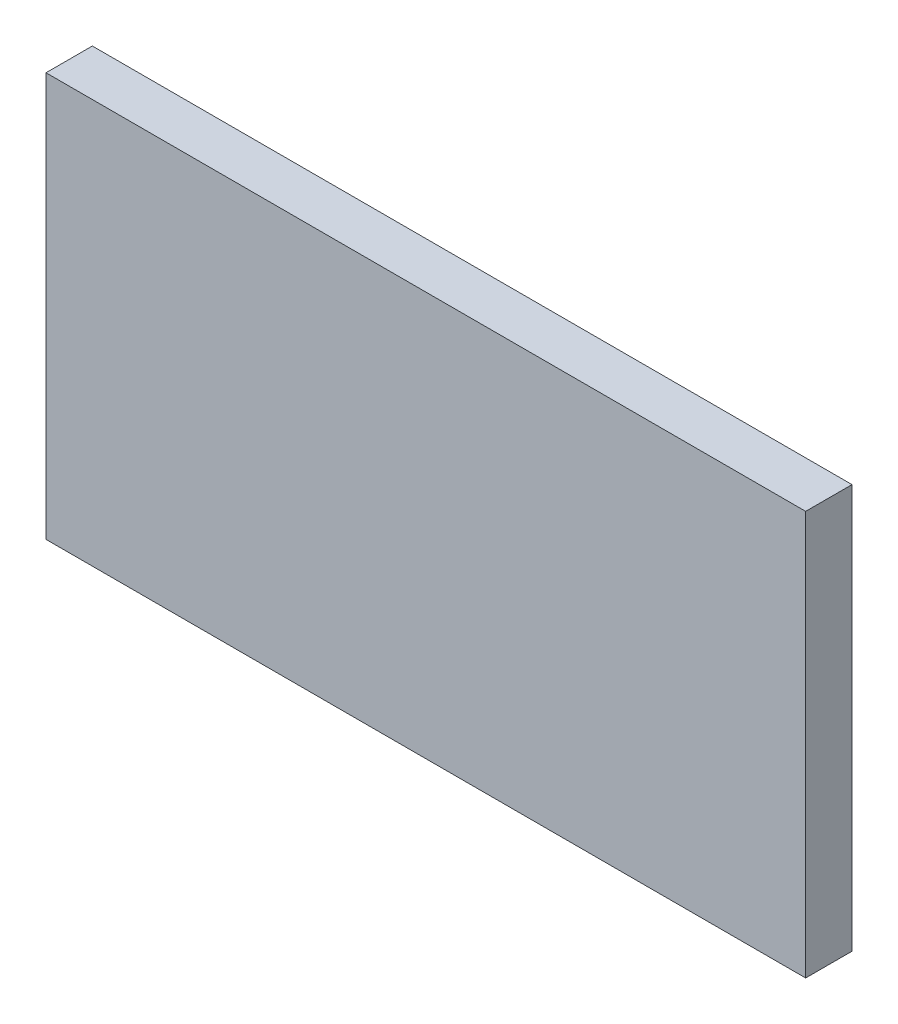
ISO-10303-21;
HEADER;
FILE_DESCRIPTION(('STEP AP214'),'2;1');
FILE_NAME('part.step','',(''),(''),'','','');
FILE_SCHEMA(('AUTOMOTIVE_DESIGN { 1 0 10303 214 1 1 1 1 }'));
ENDSEC;
DATA;
#1=APPLICATION_CONTEXT('core data for automotive mechanical design processes');
#2=APPLICATION_PROTOCOL_DEFINITION('international standard','automotive_design',2000,#1);
#3=PRODUCT_CONTEXT('',#1,'mechanical');
#4=PRODUCT('Part','Part','',(#3));
#5=PRODUCT_RELATED_PRODUCT_CATEGORY('part','',(#4));
#6=PRODUCT_DEFINITION_FORMATION('','',#4);
#7=PRODUCT_DEFINITION_CONTEXT('part definition',#1,'design');
#8=PRODUCT_DEFINITION('design','',#6,#7);
#9=PRODUCT_DEFINITION_SHAPE('','',#8);
#10=(LENGTH_UNIT() NAMED_UNIT(*) SI_UNIT(.MILLI.,.METRE.));
#11=(NAMED_UNIT(*) PLANE_ANGLE_UNIT() SI_UNIT($,.RADIAN.));
#12=(NAMED_UNIT(*) SI_UNIT($,.STERADIAN.) SOLID_ANGLE_UNIT());
#13=UNCERTAINTY_MEASURE_WITH_UNIT(LENGTH_MEASURE(1.E-05),#10,'distance_accuracy_value','');
#14=(GEOMETRIC_REPRESENTATION_CONTEXT(3) GLOBAL_UNCERTAINTY_ASSIGNED_CONTEXT((#13)) GLOBAL_UNIT_ASSIGNED_CONTEXT((#10,
#11,#12)) REPRESENTATION_CONTEXT('',''));
#15=CARTESIAN_POINT('',(0.,0.,0.));
#16=DIRECTION('',(0.,0.,1.));
#17=DIRECTION('',(1.,0.,0.));
#18=AXIS2_PLACEMENT_3D('',#15,#16,#17);
#19=CARTESIAN_POINT('',(-125.,842.370969311245,15.25));
#20=DIRECTION('',(1.,0.,0.));
#21=DIRECTION('',(0.,0.,-1.));
#22=AXIS2_PLACEMENT_3D('',#19,#20,#21);
#23=PLANE('',#22);
#24=DIRECTION('',(0.,-1.,0.));
#25=VECTOR('',#24,1.);
#26=CARTESIAN_POINT('',(-125.,842.370969311245,0.));
#27=LINE('',#26,#25);
#28=CARTESIAN_POINT('',(-125.,975.370969311245,0.));
#29=VERTEX_POINT('',#28);
#30=CARTESIAN_POINT('',(-125.,842.370969311245,0.));
#31=VERTEX_POINT('',#30);
#32=EDGE_CURVE('E96',#29,#31,#27,.T.);
#33=ORIENTED_EDGE('',*,*,#32,.T.);
#34=DIRECTION('',(0.,0.,-1.));
#35=VECTOR('',#34,1.);
#36=CARTESIAN_POINT('',(-125.,842.370969311245,15.25));
#37=LINE('',#36,#35);
#38=CARTESIAN_POINT('',(-125.,842.370969311245,15.25));
#39=VERTEX_POINT('',#38);
#40=EDGE_CURVE('E11',#39,#31,#37,.T.);
#41=ORIENTED_EDGE('',*,*,#40,.F.);
#42=DIRECTION('',(0.,-1.,0.));
#43=VECTOR('',#42,1.);
#44=CARTESIAN_POINT('',(-125.,842.370969311245,15.25));
#45=LINE('',#44,#43);
#46=CARTESIAN_POINT('',(-125.,975.370969311245,15.25));
#47=VERTEX_POINT('',#46);
#48=EDGE_CURVE('E84',#47,#39,#45,.T.);
#49=ORIENTED_EDGE('',*,*,#48,.F.);
#50=DIRECTION('',(0.,0.,-1.));
#51=VECTOR('',#50,1.);
#52=CARTESIAN_POINT('',(-125.,975.370969311245,15.25));
#53=LINE('',#52,#51);
#54=EDGE_CURVE('E92',#47,#29,#53,.T.);
#55=ORIENTED_EDGE('',*,*,#54,.T.);
#56=EDGE_LOOP('',(#33,#41,#49,#55));
#57=FACE_BOUND('',#56,.T.);
#58=ADVANCED_FACE('F33',(#57),#23,.F.);
#59=CARTESIAN_POINT('',(-125.,842.370969311245,15.25));
#60=DIRECTION('',(0.,1.,0.));
#61=DIRECTION('',(0.,0.,1.));
#62=AXIS2_PLACEMENT_3D('',#59,#60,#61);
#63=PLANE('',#62);
#64=DIRECTION('',(1.,0.,0.));
#65=VECTOR('',#64,1.);
#66=CARTESIAN_POINT('',(-125.,842.370969311245,0.));
#67=LINE('',#66,#65);
#68=CARTESIAN_POINT('',(125.,842.370969311245,0.));
#69=VERTEX_POINT('',#68);
#70=EDGE_CURVE('E88',#31,#69,#67,.T.);
#71=ORIENTED_EDGE('',*,*,#70,.T.);
#72=DIRECTION('',(0.,0.,-1.));
#73=VECTOR('',#72,1.);
#74=CARTESIAN_POINT('',(125.,842.370969311245,15.25));
#75=LINE('',#74,#73);
#76=CARTESIAN_POINT('',(125.,842.370969311245,15.25));
#77=VERTEX_POINT('',#76);
#78=EDGE_CURVE('E41',#77,#69,#75,.T.);
#79=ORIENTED_EDGE('',*,*,#78,.F.);
#80=DIRECTION('',(1.,0.,0.));
#81=VECTOR('',#80,1.);
#82=CARTESIAN_POINT('',(-125.,842.370969311245,15.25));
#83=LINE('',#82,#81);
#84=EDGE_CURVE('E79',#39,#77,#83,.T.);
#85=ORIENTED_EDGE('',*,*,#84,.F.);
#86=ORIENTED_EDGE('',*,*,#40,.T.);
#87=EDGE_LOOP('',(#71,#79,#85,#86));
#88=FACE_BOUND('',#87,.T.);
#89=ADVANCED_FACE('F87',(#88),#63,.F.);
#90=CARTESIAN_POINT('',(125.,842.370969311245,15.25));
#91=DIRECTION('',(-1.,0.,0.));
#92=DIRECTION('',(0.,-1.,0.));
#93=AXIS2_PLACEMENT_3D('',#90,#91,#92);
#94=PLANE('',#93);
#95=DIRECTION('',(0.,1.,0.));
#96=VECTOR('',#95,1.);
#97=CARTESIAN_POINT('',(125.,842.370969311245,0.));
#98=LINE('',#97,#96);
#99=CARTESIAN_POINT('',(125.,975.370969311245,0.));
#100=VERTEX_POINT('',#99);
#101=EDGE_CURVE('E66',#69,#100,#98,.T.);
#102=ORIENTED_EDGE('',*,*,#101,.T.);
#103=DIRECTION('',(0.,0.,-1.));
#104=VECTOR('',#103,1.);
#105=CARTESIAN_POINT('',(125.,975.370969311245,15.25));
#106=LINE('',#105,#104);
#107=CARTESIAN_POINT('',(125.,975.370969311245,15.25));
#108=VERTEX_POINT('',#107);
#109=EDGE_CURVE('E89',#108,#100,#106,.T.);
#110=ORIENTED_EDGE('',*,*,#109,.F.);
#111=DIRECTION('',(0.,1.,0.));
#112=VECTOR('',#111,1.);
#113=CARTESIAN_POINT('',(125.,842.370969311245,15.25));
#114=LINE('',#113,#112);
#115=EDGE_CURVE('E82',#77,#108,#114,.T.);
#116=ORIENTED_EDGE('',*,*,#115,.F.);
#117=ORIENTED_EDGE('',*,*,#78,.T.);
#118=EDGE_LOOP('',(#102,#110,#116,#117));
#119=FACE_BOUND('',#118,.T.);
#120=ADVANCED_FACE('F90',(#119),#94,.F.);
#121=CARTESIAN_POINT('',(-125.,975.370969311245,15.25));
#122=DIRECTION('',(0.,-1.,0.));
#123=DIRECTION('',(0.,0.,-1.));
#124=AXIS2_PLACEMENT_3D('',#121,#122,#123);
#125=PLANE('',#124);
#126=DIRECTION('',(-1.,0.,0.));
#127=VECTOR('',#126,1.);
#128=CARTESIAN_POINT('',(-125.,975.370969311245,0.));
#129=LINE('',#128,#127);
#130=EDGE_CURVE('E72',#100,#29,#129,.T.);
#131=ORIENTED_EDGE('',*,*,#130,.T.);
#132=ORIENTED_EDGE('',*,*,#54,.F.);
#133=DIRECTION('',(-1.,0.,0.));
#134=VECTOR('',#133,1.);
#135=CARTESIAN_POINT('',(-125.,975.370969311245,15.25));
#136=LINE('',#135,#134);
#137=EDGE_CURVE('E49',#108,#47,#136,.T.);
#138=ORIENTED_EDGE('',*,*,#137,.F.);
#139=ORIENTED_EDGE('',*,*,#109,.T.);
#140=EDGE_LOOP('',(#131,#132,#138,#139));
#141=FACE_BOUND('',#140,.T.);
#142=ADVANCED_FACE('F103',(#141),#125,.F.);
#143=CARTESIAN_POINT('',(0.,0.,15.25));
#144=DIRECTION('',(0.,0.,-1.));
#145=DIRECTION('',(-1.,0.,0.));
#146=AXIS2_PLACEMENT_3D('',#143,#144,#145);
#147=PLANE('',#146);
#148=ORIENTED_EDGE('',*,*,#48,.T.);
#149=ORIENTED_EDGE('',*,*,#84,.T.);
#150=ORIENTED_EDGE('',*,*,#115,.T.);
#151=ORIENTED_EDGE('',*,*,#137,.T.);
#152=EDGE_LOOP('',(#148,#149,#150,#151));
#153=FACE_BOUND('',#152,.T.);
#154=ADVANCED_FACE('F80',(#153),#147,.F.);
#155=CARTESIAN_POINT('',(0.,0.,0.));
#156=DIRECTION('',(0.,0.,-1.));
#157=DIRECTION('',(-1.,0.,0.));
#158=AXIS2_PLACEMENT_3D('',#155,#156,#157);
#159=PLANE('',#158);
#160=ORIENTED_EDGE('',*,*,#32,.F.);
#161=ORIENTED_EDGE('',*,*,#130,.F.);
#162=ORIENTED_EDGE('',*,*,#101,.F.);
#163=ORIENTED_EDGE('',*,*,#70,.F.);
#164=EDGE_LOOP('',(#160,#161,#162,#163));
#165=FACE_BOUND('',#164,.T.);
#166=ADVANCED_FACE('F106',(#165),#159,.T.);
#167=CLOSED_SHELL('',(#58,#89,#120,#142,#154,#166));
#168=MANIFOLD_SOLID_BREP('B2',#167);
#169=ADVANCED_BREP_SHAPE_REPRESENTATION('',(#18,#168),#14);
#170=SHAPE_DEFINITION_REPRESENTATION(#9,#169);
ENDSEC;
END-ISO-10303-21;
